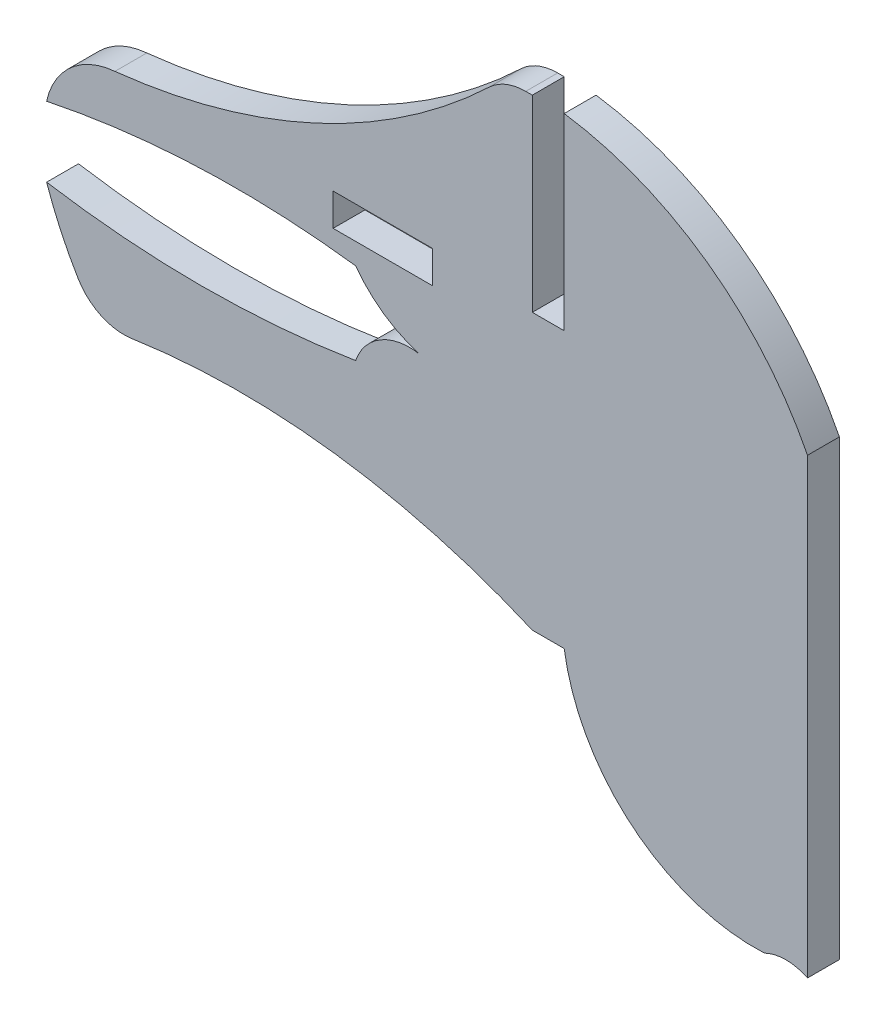
ISO-10303-21;
HEADER;
FILE_DESCRIPTION(('STEP AP214'),'2;1');
FILE_NAME('part.step','',(''),(''),'','','');
FILE_SCHEMA(('AUTOMOTIVE_DESIGN { 1 0 10303 214 1 1 1 1 }'));
ENDSEC;
DATA;
#1=APPLICATION_CONTEXT('core data for automotive mechanical design processes');
#2=APPLICATION_PROTOCOL_DEFINITION('international standard','automotive_design',2000,#1);
#3=PRODUCT_CONTEXT('',#1,'mechanical');
#4=PRODUCT('Part','Part','',(#3));
#5=PRODUCT_RELATED_PRODUCT_CATEGORY('part','',(#4));
#6=PRODUCT_DEFINITION_FORMATION('','',#4);
#7=PRODUCT_DEFINITION_CONTEXT('part definition',#1,'design');
#8=PRODUCT_DEFINITION('design','',#6,#7);
#9=PRODUCT_DEFINITION_SHAPE('','',#8);
#10=(LENGTH_UNIT() NAMED_UNIT(*) SI_UNIT(.MILLI.,.METRE.));
#11=(NAMED_UNIT(*) PLANE_ANGLE_UNIT() SI_UNIT($,.RADIAN.));
#12=(NAMED_UNIT(*) SI_UNIT($,.STERADIAN.) SOLID_ANGLE_UNIT());
#13=UNCERTAINTY_MEASURE_WITH_UNIT(LENGTH_MEASURE(1.E-05),#10,'distance_accuracy_value','');
#14=(GEOMETRIC_REPRESENTATION_CONTEXT(3) GLOBAL_UNCERTAINTY_ASSIGNED_CONTEXT((#13)) GLOBAL_UNIT_ASSIGNED_CONTEXT((#10,
#11,#12)) REPRESENTATION_CONTEXT('',''));
#15=CARTESIAN_POINT('',(0.,0.,0.));
#16=DIRECTION('',(0.,0.,1.));
#17=DIRECTION('',(1.,0.,0.));
#18=AXIS2_PLACEMENT_3D('',#15,#16,#17);
#19=CARTESIAN_POINT('',(-2.17746130734827,9.10857617639714,1.524));
#20=DIRECTION('',(0.,0.,-1.));
#21=DIRECTION('',(-1.,0.,0.));
#22=AXIS2_PLACEMENT_3D('',#19,#20,#21);
#23=PLANE('',#22);
#24=DIRECTION('',(0.,-1.,0.));
#25=VECTOR('',#24,1.);
#26=CARTESIAN_POINT('',(0.,15.4404111186023,1.524));
#27=LINE('',#26,#25);
#28=CARTESIAN_POINT('',(0.,24.4351758524362,1.524));
#29=VERTEX_POINT('',#28);
#30=CARTESIAN_POINT('',(0.,15.4404111186023,1.524));
#31=VERTEX_POINT('',#30);
#32=EDGE_CURVE('E221',#29,#31,#27,.T.);
#33=ORIENTED_EDGE('',*,*,#32,.T.);
#34=DIRECTION('',(-1.,0.,0.));
#35=VECTOR('',#34,1.);
#36=CARTESIAN_POINT('',(0.,15.4404111186023,1.524));
#37=LINE('',#36,#35);
#38=CARTESIAN_POINT('',(-1.524,15.4404111186023,1.524));
#39=VERTEX_POINT('',#38);
#40=EDGE_CURVE('E224',#31,#39,#37,.T.);
#41=ORIENTED_EDGE('',*,*,#40,.T.);
#42=DIRECTION('',(0.,1.,0.));
#43=VECTOR('',#42,1.);
#44=CARTESIAN_POINT('',(-1.524,15.4404111186023,1.524));
#45=LINE('',#44,#43);
#46=CARTESIAN_POINT('',(-1.524,24.4351758524362,1.524));
#47=VERTEX_POINT('',#46);
#48=EDGE_CURVE('E227',#39,#47,#45,.T.);
#49=ORIENTED_EDGE('',*,*,#48,.T.);
#50=DIRECTION('',(-1.,0.,0.));
#51=VECTOR('',#50,1.);
#52=CARTESIAN_POINT('',(-1.524,24.4351758524362,1.524));
#53=LINE('',#52,#51);
#54=CARTESIAN_POINT('',(-1.83677867417803,24.4351758524362,1.524));
#55=VERTEX_POINT('',#54);
#56=EDGE_CURVE('E229',#47,#55,#53,.T.);
#57=ORIENTED_EDGE('',*,*,#56,.T.);
#58=CARTESIAN_POINT('',(-1.83677867417803,21.8951758524362,1.524));
#59=DIRECTION('',(0.,0.,1.));
#60=DIRECTION('',(1.,0.,0.));
#61=AXIS2_PLACEMENT_3D('',#58,#59,#60);
#62=CIRCLE('',#61,2.54);
#63=CARTESIAN_POINT('',(-3.58920349451574,23.7338186260777,1.524));
#64=VERTEX_POINT('',#63);
#65=EDGE_CURVE('E231',#55,#64,#62,.T.);
#66=ORIENTED_EDGE('',*,*,#65,.T.);
#67=CARTESIAN_POINT('',(-24.7471923791564,45.9327642904265,1.524));
#68=DIRECTION('',(0.,0.,-1.));
#69=DIRECTION('',(-1.,0.,0.));
#70=AXIS2_PLACEMENT_3D('',#67,#68,#69);
#71=CIRCLE('',#70,30.6668172827127);
#72=CARTESIAN_POINT('',(-21.4806834941186,15.4404111186023,1.524));
#73=VERTEX_POINT('',#72);
#74=EDGE_CURVE('E233',#64,#73,#71,.T.);
#75=ORIENTED_EDGE('',*,*,#74,.T.);
#76=CARTESIAN_POINT('',(-21.172457197436,11.7960237267086,1.524));
#77=DIRECTION('',(0.,0.,1.));
#78=DIRECTION('',(1.,0.,0.));
#79=AXIS2_PLACEMENT_3D('',#76,#77,#78);
#80=CIRCLE('',#79,3.6573983802917);
#81=CARTESIAN_POINT('',(-24.7471923791564,12.5692192341518,1.524));
#82=VERTEX_POINT('',#81);
#83=EDGE_CURVE('E235',#73,#82,#80,.T.);
#84=ORIENTED_EDGE('',*,*,#83,.T.);
#85=CARTESIAN_POINT('',(-15.6510089215253,-31.1556557756089,1.524));
#86=DIRECTION('',(0.,0.,-1.));
#87=DIRECTION('',(-1.,0.,0.));
#88=AXIS2_PLACEMENT_3D('',#85,#86,#87);
#89=CIRCLE('',#88,44.6610036621892);
#90=CARTESIAN_POINT('',(-9.97279177913877,13.1429119009874,1.524));
#91=VERTEX_POINT('',#90);
#92=EDGE_CURVE('E237',#82,#91,#89,.T.);
#93=ORIENTED_EDGE('',*,*,#92,.T.);
#94=CARTESIAN_POINT('',(-5.35148518065487,16.5259518202602,1.524));
#95=DIRECTION('',(0.,0.,1.));
#96=DIRECTION('',(1.,0.,0.));
#97=AXIS2_PLACEMENT_3D('',#94,#95,#96);
#98=CIRCLE('',#97,5.72725359771888);
#99=CARTESIAN_POINT('',(-6.9059223319127,11.0136783405267,1.524));
#100=VERTEX_POINT('',#99);
#101=EDGE_CURVE('E239',#91,#100,#98,.T.);
#102=ORIENTED_EDGE('',*,*,#101,.T.);
#103=CARTESIAN_POINT('',(-7.3881311477758,8.31986254893477,1.524));
#104=DIRECTION('',(0.,0.,1.));
#105=DIRECTION('',(1.,0.,0.));
#106=AXIS2_PLACEMENT_3D('',#103,#104,#105);
#107=CIRCLE('',#106,2.73663458670061);
#108=CARTESIAN_POINT('',(-9.97279177913877,9.21913908138094,1.524));
#109=VERTEX_POINT('',#108);
#110=EDGE_CURVE('E241',#100,#109,#107,.T.);
#111=ORIENTED_EDGE('',*,*,#110,.T.);
#112=CARTESIAN_POINT('',(-17.3599920791476,54.9064911056629,1.524));
#113=DIRECTION('',(0.,0.,-1.));
#114=DIRECTION('',(-1.,0.,0.));
#115=AXIS2_PLACEMENT_3D('',#112,#113,#114);
#116=CIRCLE('',#115,46.2807180504269);
#117=CARTESIAN_POINT('',(-24.7471923791564,9.21913908138094,1.524));
#118=VERTEX_POINT('',#117);
#119=EDGE_CURVE('E243',#109,#118,#116,.T.);
#120=ORIENTED_EDGE('',*,*,#119,.T.);
#121=CARTESIAN_POINT('',(-8.62738716595611,14.7511932063634,1.524));
#122=DIRECTION('',(0.,0.,1.));
#123=DIRECTION('',(1.,0.,0.));
#124=AXIS2_PLACEMENT_3D('',#121,#122,#123);
#125=CIRCLE('',#124,17.0426448344515);
#126=CARTESIAN_POINT('',(-23.2415795241672,5.98323308610391,1.524));
#127=VERTEX_POINT('',#126);
#128=EDGE_CURVE('E245',#118,#127,#125,.T.);
#129=ORIENTED_EDGE('',*,*,#128,.T.);
#130=CARTESIAN_POINT('',(-21.0635109819642,7.28999145147448,1.524));
#131=DIRECTION('',(0.,0.,1.));
#132=DIRECTION('',(1.,0.,0.));
#133=AXIS2_PLACEMENT_3D('',#130,#131,#132);
#134=CIRCLE('',#133,2.54);
#135=CARTESIAN_POINT('',(-20.6892752704858,4.77771208160849,1.524));
#136=VERTEX_POINT('',#135);
#137=EDGE_CURVE('E247',#127,#136,#134,.T.);
#138=ORIENTED_EDGE('',*,*,#137,.T.);
#139=CARTESIAN_POINT('',(-15.4904405327496,-30.1225522661208,1.524));
#140=DIRECTION('',(0.,0.,-1.));
#141=DIRECTION('',(-1.,0.,0.));
#142=AXIS2_PLACEMENT_3D('',#139,#140,#141);
#143=CIRCLE('',#142,35.2853558033879);
#144=CARTESIAN_POINT('',(-1.524,2.28107211475434,1.524));
#145=VERTEX_POINT('',#144);
#146=EDGE_CURVE('E249',#136,#145,#143,.T.);
#147=ORIENTED_EDGE('',*,*,#146,.T.);
#148=DIRECTION('',(1.,0.,0.));
#149=VECTOR('',#148,1.);
#150=CARTESIAN_POINT('',(-1.524,2.28107211475434,1.524));
#151=LINE('',#150,#149);
#152=CARTESIAN_POINT('',(0.,2.28107211475434,1.524));
#153=VERTEX_POINT('',#152);
#154=EDGE_CURVE('E251',#145,#153,#151,.T.);
#155=ORIENTED_EDGE('',*,*,#154,.T.);
#156=CARTESIAN_POINT('',(9.12449001778718,3.67526044076234,1.524));
#157=DIRECTION('',(0.,0.,1.));
#158=DIRECTION('',(1.,0.,0.));
#159=AXIS2_PLACEMENT_3D('',#156,#157,#158);
#160=CIRCLE('',#159,9.23038889609072);
#161=CARTESIAN_POINT('',(9.57377877406707,-5.54418741616247,1.524));
#162=VERTEX_POINT('',#161);
#163=EDGE_CURVE('E253',#153,#162,#160,.T.);
#164=ORIENTED_EDGE('',*,*,#163,.T.);
#165=CARTESIAN_POINT('',(10.6038513011269,-7.65293443311951,1.524));
#166=DIRECTION('',(0.,0.,-1.));
#167=DIRECTION('',(1.,0.,0.));
#168=AXIS2_PLACEMENT_3D('',#165,#166,#167);
#169=CIRCLE('',#168,2.34688376204035);
#170=CARTESIAN_POINT('',(11.6339238281867,-5.54418741616247,1.524));
#171=VERTEX_POINT('',#170);
#172=EDGE_CURVE('E255',#162,#171,#169,.T.);
#173=ORIENTED_EDGE('',*,*,#172,.T.);
#174=DIRECTION('',(0.,1.,0.));
#175=VECTOR('',#174,1.);
#176=CARTESIAN_POINT('',(11.6339238281867,16.1008316074066,1.524));
#177=LINE('',#176,#175);
#178=CARTESIAN_POINT('',(11.6339238281867,16.1008316074066,1.524));
#179=VERTEX_POINT('',#178);
#180=EDGE_CURVE('E257',#171,#179,#177,.T.);
#181=ORIENTED_EDGE('',*,*,#180,.T.);
#182=CARTESIAN_POINT('',(-2.17746130734827,9.10857617639714,1.524));
#183=DIRECTION('',(0.,0.,1.));
#184=DIRECTION('',(-1.,0.,0.));
#185=AXIS2_PLACEMENT_3D('',#182,#183,#184);
#186=CIRCLE('',#185,15.4805037183729);
#187=EDGE_CURVE('E259',#179,#29,#186,.T.);
#188=ORIENTED_EDGE('',*,*,#187,.T.);
#189=EDGE_LOOP('',(#33,#41,#49,#57,#66,#75,#84,#93,#102,#111,#120,#129,#138,#147,#155,#164,#173,
#181,#188));
#190=FACE_BOUND('',#189,.T.);
#191=DIRECTION('',(0.,-1.,0.));
#192=VECTOR('',#191,1.);
#193=CARTESIAN_POINT('',(-11.049,15.7018868321709,1.524));
#194=LINE('',#193,#192);
#195=CARTESIAN_POINT('',(-11.049,15.7018868321709,1.524));
#196=VERTEX_POINT('',#195);
#197=CARTESIAN_POINT('',(-11.049,14.1562025878202,1.524));
#198=VERTEX_POINT('',#197);
#199=EDGE_CURVE('E185',#196,#198,#194,.T.);
#200=ORIENTED_EDGE('',*,*,#199,.F.);
#201=DIRECTION('',(-1.,0.,0.));
#202=VECTOR('',#201,1.);
#203=CARTESIAN_POINT('',(-11.049,15.7018868321709,1.524));
#204=LINE('',#203,#202);
#205=CARTESIAN_POINT('',(-6.2865,15.7018868321709,1.524));
#206=VERTEX_POINT('',#205);
#207=EDGE_CURVE('E207',#206,#196,#204,.T.);
#208=ORIENTED_EDGE('',*,*,#207,.F.);
#209=DIRECTION('',(0.,1.,0.));
#210=VECTOR('',#209,1.);
#211=CARTESIAN_POINT('',(-6.2865,15.7018868321709,1.524));
#212=LINE('',#211,#210);
#213=CARTESIAN_POINT('',(-6.2865,14.1562025878202,1.524));
#214=VERTEX_POINT('',#213);
#215=EDGE_CURVE('E205',#214,#206,#212,.T.);
#216=ORIENTED_EDGE('',*,*,#215,.F.);
#217=DIRECTION('',(1.,0.,0.));
#218=VECTOR('',#217,1.);
#219=CARTESIAN_POINT('',(-11.049,14.1562025878202,1.524));
#220=LINE('',#219,#218);
#221=EDGE_CURVE('E193',#198,#214,#220,.T.);
#222=ORIENTED_EDGE('',*,*,#221,.F.);
#223=EDGE_LOOP('',(#200,#208,#216,#222));
#224=FACE_BOUND('',#223,.T.);
#225=ADVANCED_FACE('F30',(#190,#224),#23,.F.);
#226=CARTESIAN_POINT('',(-2.17746130734827,9.10857617639714,0.));
#227=DIRECTION('',(0.,0.,-1.));
#228=DIRECTION('',(-1.,0.,0.));
#229=AXIS2_PLACEMENT_3D('',#226,#227,#228);
#230=PLANE('',#229);
#231=DIRECTION('',(0.,-1.,0.));
#232=VECTOR('',#231,1.);
#233=CARTESIAN_POINT('',(0.,15.4404111186023,0.));
#234=LINE('',#233,#232);
#235=CARTESIAN_POINT('',(0.,24.4351758524362,0.));
#236=VERTEX_POINT('',#235);
#237=CARTESIAN_POINT('',(0.,15.4404111186023,0.));
#238=VERTEX_POINT('',#237);
#239=EDGE_CURVE('E201',#236,#238,#234,.T.);
#240=ORIENTED_EDGE('',*,*,#239,.F.);
#241=CARTESIAN_POINT('',(-2.17746130734827,9.10857617639714,0.));
#242=DIRECTION('',(0.,0.,1.));
#243=DIRECTION('',(-1.,0.,0.));
#244=AXIS2_PLACEMENT_3D('',#241,#242,#243);
#245=CIRCLE('',#244,15.4805037183729);
#246=CARTESIAN_POINT('',(11.6339238281867,16.1008316074066,0.));
#247=VERTEX_POINT('',#246);
#248=EDGE_CURVE('E225',#247,#236,#245,.T.);
#249=ORIENTED_EDGE('',*,*,#248,.F.);
#250=DIRECTION('',(0.,1.,0.));
#251=VECTOR('',#250,1.);
#252=CARTESIAN_POINT('',(11.6339238281867,16.1008316074066,0.));
#253=LINE('',#252,#251);
#254=CARTESIAN_POINT('',(11.6339238281867,-5.54418741616247,0.));
#255=VERTEX_POINT('',#254);
#256=EDGE_CURVE('E296',#255,#247,#253,.T.);
#257=ORIENTED_EDGE('',*,*,#256,.F.);
#258=CARTESIAN_POINT('',(10.6038513011269,-7.65293443311951,0.));
#259=DIRECTION('',(0.,0.,-1.));
#260=DIRECTION('',(1.,0.,0.));
#261=AXIS2_PLACEMENT_3D('',#258,#259,#260);
#262=CIRCLE('',#261,2.34688376204035);
#263=CARTESIAN_POINT('',(9.57377877406707,-5.54418741616247,0.));
#264=VERTEX_POINT('',#263);
#265=EDGE_CURVE('E294',#264,#255,#262,.T.);
#266=ORIENTED_EDGE('',*,*,#265,.F.);
#267=CARTESIAN_POINT('',(9.12449001778718,3.67526044076234,0.));
#268=DIRECTION('',(0.,0.,1.));
#269=DIRECTION('',(1.,0.,0.));
#270=AXIS2_PLACEMENT_3D('',#267,#268,#269);
#271=CIRCLE('',#270,9.23038889609072);
#272=CARTESIAN_POINT('',(0.,2.28107211475434,0.));
#273=VERTEX_POINT('',#272);
#274=EDGE_CURVE('E292',#273,#264,#271,.T.);
#275=ORIENTED_EDGE('',*,*,#274,.F.);
#276=DIRECTION('',(1.,0.,0.));
#277=VECTOR('',#276,1.);
#278=CARTESIAN_POINT('',(-1.524,2.28107211475434,0.));
#279=LINE('',#278,#277);
#280=CARTESIAN_POINT('',(-1.524,2.28107211475434,0.));
#281=VERTEX_POINT('',#280);
#282=EDGE_CURVE('E290',#281,#273,#279,.T.);
#283=ORIENTED_EDGE('',*,*,#282,.F.);
#284=CARTESIAN_POINT('',(-15.4904405327496,-30.1225522661208,0.));
#285=DIRECTION('',(0.,0.,-1.));
#286=DIRECTION('',(-1.,0.,0.));
#287=AXIS2_PLACEMENT_3D('',#284,#285,#286);
#288=CIRCLE('',#287,35.2853558033879);
#289=CARTESIAN_POINT('',(-20.6892752704858,4.77771208160849,0.));
#290=VERTEX_POINT('',#289);
#291=EDGE_CURVE('E288',#290,#281,#288,.T.);
#292=ORIENTED_EDGE('',*,*,#291,.F.);
#293=CARTESIAN_POINT('',(-21.0635109819642,7.28999145147448,0.));
#294=DIRECTION('',(0.,0.,1.));
#295=DIRECTION('',(1.,0.,0.));
#296=AXIS2_PLACEMENT_3D('',#293,#294,#295);
#297=CIRCLE('',#296,2.54);
#298=CARTESIAN_POINT('',(-23.2415795241672,5.98323308610391,0.));
#299=VERTEX_POINT('',#298);
#300=EDGE_CURVE('E286',#299,#290,#297,.T.);
#301=ORIENTED_EDGE('',*,*,#300,.F.);
#302=CARTESIAN_POINT('',(-8.62738716595611,14.7511932063634,0.));
#303=DIRECTION('',(0.,0.,1.));
#304=DIRECTION('',(1.,0.,0.));
#305=AXIS2_PLACEMENT_3D('',#302,#303,#304);
#306=CIRCLE('',#305,17.0426448344515);
#307=CARTESIAN_POINT('',(-24.7471923791564,9.21913908138094,0.));
#308=VERTEX_POINT('',#307);
#309=EDGE_CURVE('E284',#308,#299,#306,.T.);
#310=ORIENTED_EDGE('',*,*,#309,.F.);
#311=CARTESIAN_POINT('',(-17.3599920791476,54.9064911056629,0.));
#312=DIRECTION('',(0.,0.,-1.));
#313=DIRECTION('',(-1.,0.,0.));
#314=AXIS2_PLACEMENT_3D('',#311,#312,#313);
#315=CIRCLE('',#314,46.2807180504269);
#316=CARTESIAN_POINT('',(-9.97279177913877,9.21913908138094,0.));
#317=VERTEX_POINT('',#316);
#318=EDGE_CURVE('E282',#317,#308,#315,.T.);
#319=ORIENTED_EDGE('',*,*,#318,.F.);
#320=CARTESIAN_POINT('',(-7.3881311477758,8.31986254893477,0.));
#321=DIRECTION('',(0.,0.,1.));
#322=DIRECTION('',(1.,0.,0.));
#323=AXIS2_PLACEMENT_3D('',#320,#321,#322);
#324=CIRCLE('',#323,2.73663458670061);
#325=CARTESIAN_POINT('',(-6.9059223319127,11.0136783405267,0.));
#326=VERTEX_POINT('',#325);
#327=EDGE_CURVE('E280',#326,#317,#324,.T.);
#328=ORIENTED_EDGE('',*,*,#327,.F.);
#329=CARTESIAN_POINT('',(-5.35148518065487,16.5259518202602,0.));
#330=DIRECTION('',(0.,0.,1.));
#331=DIRECTION('',(1.,0.,0.));
#332=AXIS2_PLACEMENT_3D('',#329,#330,#331);
#333=CIRCLE('',#332,5.72725359771888);
#334=CARTESIAN_POINT('',(-9.97279177913877,13.1429119009874,0.));
#335=VERTEX_POINT('',#334);
#336=EDGE_CURVE('E278',#335,#326,#333,.T.);
#337=ORIENTED_EDGE('',*,*,#336,.F.);
#338=CARTESIAN_POINT('',(-15.6510089215253,-31.1556557756089,0.));
#339=DIRECTION('',(0.,0.,-1.));
#340=DIRECTION('',(-1.,0.,0.));
#341=AXIS2_PLACEMENT_3D('',#338,#339,#340);
#342=CIRCLE('',#341,44.6610036621892);
#343=CARTESIAN_POINT('',(-24.7471923791564,12.5692192341518,0.));
#344=VERTEX_POINT('',#343);
#345=EDGE_CURVE('E276',#344,#335,#342,.T.);
#346=ORIENTED_EDGE('',*,*,#345,.F.);
#347=CARTESIAN_POINT('',(-21.172457197436,11.7960237267086,0.));
#348=DIRECTION('',(0.,0.,1.));
#349=DIRECTION('',(1.,0.,0.));
#350=AXIS2_PLACEMENT_3D('',#347,#348,#349);
#351=CIRCLE('',#350,3.6573983802917);
#352=CARTESIAN_POINT('',(-21.4806834941186,15.4404111186023,0.));
#353=VERTEX_POINT('',#352);
#354=EDGE_CURVE('E274',#353,#344,#351,.T.);
#355=ORIENTED_EDGE('',*,*,#354,.F.);
#356=CARTESIAN_POINT('',(-24.7471923791564,45.9327642904265,0.));
#357=DIRECTION('',(0.,0.,-1.));
#358=DIRECTION('',(-1.,0.,0.));
#359=AXIS2_PLACEMENT_3D('',#356,#357,#358);
#360=CIRCLE('',#359,30.6668172827127);
#361=CARTESIAN_POINT('',(-3.58920349451574,23.7338186260777,0.));
#362=VERTEX_POINT('',#361);
#363=EDGE_CURVE('E272',#362,#353,#360,.T.);
#364=ORIENTED_EDGE('',*,*,#363,.F.);
#365=CARTESIAN_POINT('',(-1.83677867417803,21.8951758524362,0.));
#366=DIRECTION('',(0.,0.,1.));
#367=DIRECTION('',(1.,0.,0.));
#368=AXIS2_PLACEMENT_3D('',#365,#366,#367);
#369=CIRCLE('',#368,2.54);
#370=CARTESIAN_POINT('',(-1.83677867417803,24.4351758524362,0.));
#371=VERTEX_POINT('',#370);
#372=EDGE_CURVE('E270',#371,#362,#369,.T.);
#373=ORIENTED_EDGE('',*,*,#372,.F.);
#374=DIRECTION('',(-1.,0.,0.));
#375=VECTOR('',#374,1.);
#376=CARTESIAN_POINT('',(-1.524,24.4351758524362,0.));
#377=LINE('',#376,#375);
#378=CARTESIAN_POINT('',(-1.524,24.4351758524362,0.));
#379=VERTEX_POINT('',#378);
#380=EDGE_CURVE('E268',#379,#371,#377,.T.);
#381=ORIENTED_EDGE('',*,*,#380,.F.);
#382=DIRECTION('',(0.,1.,0.));
#383=VECTOR('',#382,1.);
#384=CARTESIAN_POINT('',(-1.524,15.4404111186023,0.));
#385=LINE('',#384,#383);
#386=CARTESIAN_POINT('',(-1.524,15.4404111186023,0.));
#387=VERTEX_POINT('',#386);
#388=EDGE_CURVE('E266',#387,#379,#385,.T.);
#389=ORIENTED_EDGE('',*,*,#388,.F.);
#390=DIRECTION('',(-1.,0.,0.));
#391=VECTOR('',#390,1.);
#392=CARTESIAN_POINT('',(0.,15.4404111186023,0.));
#393=LINE('',#392,#391);
#394=EDGE_CURVE('E264',#238,#387,#393,.T.);
#395=ORIENTED_EDGE('',*,*,#394,.F.);
#396=EDGE_LOOP('',(#240,#249,#257,#266,#275,#283,#292,#301,#310,#319,#328,#337,#346,#355,#364,
#373,#381,#389,#395));
#397=FACE_BOUND('',#396,.T.);
#398=DIRECTION('',(-1.,0.,0.));
#399=VECTOR('',#398,1.);
#400=CARTESIAN_POINT('',(-11.049,15.7018868321709,0.));
#401=LINE('',#400,#399);
#402=CARTESIAN_POINT('',(-6.2865,15.7018868321709,0.));
#403=VERTEX_POINT('',#402);
#404=CARTESIAN_POINT('',(-11.049,15.7018868321709,0.));
#405=VERTEX_POINT('',#404);
#406=EDGE_CURVE('E194',#403,#405,#401,.T.);
#407=ORIENTED_EDGE('',*,*,#406,.T.);
#408=DIRECTION('',(0.,-1.,0.));
#409=VECTOR('',#408,1.);
#410=CARTESIAN_POINT('',(-11.049,15.7018868321709,0.));
#411=LINE('',#410,#409);
#412=CARTESIAN_POINT('',(-11.049,14.1562025878202,0.));
#413=VERTEX_POINT('',#412);
#414=EDGE_CURVE('E53',#405,#413,#411,.T.);
#415=ORIENTED_EDGE('',*,*,#414,.T.);
#416=DIRECTION('',(1.,0.,0.));
#417=VECTOR('',#416,1.);
#418=CARTESIAN_POINT('',(-11.049,14.1562025878202,0.));
#419=LINE('',#418,#417);
#420=CARTESIAN_POINT('',(-6.2865,14.1562025878202,0.));
#421=VERTEX_POINT('',#420);
#422=EDGE_CURVE('E200',#413,#421,#419,.T.);
#423=ORIENTED_EDGE('',*,*,#422,.T.);
#424=DIRECTION('',(0.,1.,0.));
#425=VECTOR('',#424,1.);
#426=CARTESIAN_POINT('',(-6.2865,15.7018868321709,0.));
#427=LINE('',#426,#425);
#428=EDGE_CURVE('E213',#421,#403,#427,.T.);
#429=ORIENTED_EDGE('',*,*,#428,.T.);
#430=EDGE_LOOP('',(#407,#415,#423,#429));
#431=FACE_BOUND('',#430,.T.);
#432=ADVANCED_FACE('F359',(#397,#431),#230,.T.);
#433=CARTESIAN_POINT('',(0.,15.4404111186023,1.524));
#434=DIRECTION('',(1.,0.,0.));
#435=DIRECTION('',(0.,0.,-1.));
#436=AXIS2_PLACEMENT_3D('',#433,#434,#435);
#437=PLANE('',#436);
#438=ORIENTED_EDGE('',*,*,#239,.T.);
#439=DIRECTION('',(0.,0.,-1.));
#440=VECTOR('',#439,1.);
#441=CARTESIAN_POINT('',(0.,15.4404111186023,1.524));
#442=LINE('',#441,#440);
#443=EDGE_CURVE('E11',#31,#238,#442,.T.);
#444=ORIENTED_EDGE('',*,*,#443,.F.);
#445=ORIENTED_EDGE('',*,*,#32,.F.);
#446=DIRECTION('',(0.,0.,-1.));
#447=VECTOR('',#446,1.);
#448=CARTESIAN_POINT('',(0.,24.4351758524362,1.524));
#449=LINE('',#448,#447);
#450=EDGE_CURVE('E261',#29,#236,#449,.T.);
#451=ORIENTED_EDGE('',*,*,#450,.T.);
#452=EDGE_LOOP('',(#438,#444,#445,#451));
#453=FACE_BOUND('',#452,.T.);
#454=ADVANCED_FACE('F32',(#453),#437,.F.);
#455=CARTESIAN_POINT('',(0.,15.4404111186023,1.524));
#456=DIRECTION('',(0.,-1.,0.));
#457=DIRECTION('',(0.,0.,-1.));
#458=AXIS2_PLACEMENT_3D('',#455,#456,#457);
#459=PLANE('',#458);
#460=ORIENTED_EDGE('',*,*,#394,.T.);
#461=DIRECTION('',(0.,0.,-1.));
#462=VECTOR('',#461,1.);
#463=CARTESIAN_POINT('',(-1.524,15.4404111186023,1.524));
#464=LINE('',#463,#462);
#465=EDGE_CURVE('E38',#39,#387,#464,.T.);
#466=ORIENTED_EDGE('',*,*,#465,.F.);
#467=ORIENTED_EDGE('',*,*,#40,.F.);
#468=ORIENTED_EDGE('',*,*,#443,.T.);
#469=EDGE_LOOP('',(#460,#466,#467,#468));
#470=FACE_BOUND('',#469,.T.);
#471=ADVANCED_FACE('F376',(#470),#459,.F.);
#472=CARTESIAN_POINT('',(-1.524,15.4404111186023,1.524));
#473=DIRECTION('',(-1.,0.,0.));
#474=DIRECTION('',(0.,0.,1.));
#475=AXIS2_PLACEMENT_3D('',#472,#473,#474);
#476=PLANE('',#475);
#477=ORIENTED_EDGE('',*,*,#388,.T.);
#478=DIRECTION('',(0.,0.,-1.));
#479=VECTOR('',#478,1.);
#480=CARTESIAN_POINT('',(-1.524,24.4351758524362,1.524));
#481=LINE('',#480,#479);
#482=EDGE_CURVE('E346',#47,#379,#481,.T.);
#483=ORIENTED_EDGE('',*,*,#482,.F.);
#484=ORIENTED_EDGE('',*,*,#48,.F.);
#485=ORIENTED_EDGE('',*,*,#465,.T.);
#486=EDGE_LOOP('',(#477,#483,#484,#485));
#487=FACE_BOUND('',#486,.T.);
#488=ADVANCED_FACE('F353',(#487),#476,.F.);
#489=CARTESIAN_POINT('',(-1.524,24.4351758524362,1.524));
#490=DIRECTION('',(0.,-1.,0.));
#491=DIRECTION('',(0.,0.,-1.));
#492=AXIS2_PLACEMENT_3D('',#489,#490,#491);
#493=PLANE('',#492);
#494=ORIENTED_EDGE('',*,*,#380,.T.);
#495=DIRECTION('',(0.,0.,-1.));
#496=VECTOR('',#495,1.);
#497=CARTESIAN_POINT('',(-1.83677867417803,24.4351758524362,1.524));
#498=LINE('',#497,#496);
#499=EDGE_CURVE('E343',#55,#371,#498,.T.);
#500=ORIENTED_EDGE('',*,*,#499,.F.);
#501=ORIENTED_EDGE('',*,*,#56,.F.);
#502=ORIENTED_EDGE('',*,*,#482,.T.);
#503=EDGE_LOOP('',(#494,#500,#501,#502));
#504=FACE_BOUND('',#503,.T.);
#505=ADVANCED_FACE('F365',(#504),#493,.F.);
#506=CARTESIAN_POINT('',(-1.83677867417803,21.8951758524362,1.524));
#507=DIRECTION('',(0.,0.,-1.));
#508=DIRECTION('',(-1.,0.,0.));
#509=AXIS2_PLACEMENT_3D('',#506,#507,#508);
#510=CYLINDRICAL_SURFACE('',#509,2.54);
#511=ORIENTED_EDGE('',*,*,#372,.T.);
#512=DIRECTION('',(0.,0.,-1.));
#513=VECTOR('',#512,1.);
#514=CARTESIAN_POINT('',(-3.58920349451574,23.7338186260777,1.524));
#515=LINE('',#514,#513);
#516=EDGE_CURVE('E340',#64,#362,#515,.T.);
#517=ORIENTED_EDGE('',*,*,#516,.F.);
#518=ORIENTED_EDGE('',*,*,#65,.F.);
#519=ORIENTED_EDGE('',*,*,#499,.T.);
#520=EDGE_LOOP('',(#511,#517,#518,#519));
#521=FACE_BOUND('',#520,.T.);
#522=ADVANCED_FACE('F369',(#521),#510,.T.);
#523=CARTESIAN_POINT('',(-24.7471923791564,45.9327642904265,1.524));
#524=DIRECTION('',(0.,0.,-1.));
#525=DIRECTION('',(-1.,0.,0.));
#526=AXIS2_PLACEMENT_3D('',#523,#524,#525);
#527=CYLINDRICAL_SURFACE('',#526,30.6668172827127);
#528=ORIENTED_EDGE('',*,*,#363,.T.);
#529=DIRECTION('',(0.,0.,-1.));
#530=VECTOR('',#529,1.);
#531=CARTESIAN_POINT('',(-21.4806834941186,15.4404111186023,1.524));
#532=LINE('',#531,#530);
#533=EDGE_CURVE('E337',#73,#353,#532,.T.);
#534=ORIENTED_EDGE('',*,*,#533,.F.);
#535=ORIENTED_EDGE('',*,*,#74,.F.);
#536=ORIENTED_EDGE('',*,*,#516,.T.);
#537=EDGE_LOOP('',(#528,#534,#535,#536));
#538=FACE_BOUND('',#537,.T.);
#539=ADVANCED_FACE('F444',(#538),#527,.F.);
#540=CARTESIAN_POINT('',(-21.172457197436,11.7960237267086,1.524));
#541=DIRECTION('',(0.,0.,-1.));
#542=DIRECTION('',(-1.,0.,0.));
#543=AXIS2_PLACEMENT_3D('',#540,#541,#542);
#544=CYLINDRICAL_SURFACE('',#543,3.6573983802917);
#545=ORIENTED_EDGE('',*,*,#354,.T.);
#546=DIRECTION('',(0.,0.,-1.));
#547=VECTOR('',#546,1.);
#548=CARTESIAN_POINT('',(-24.7471923791564,12.5692192341518,1.524));
#549=LINE('',#548,#547);
#550=EDGE_CURVE('E334',#82,#344,#549,.T.);
#551=ORIENTED_EDGE('',*,*,#550,.F.);
#552=ORIENTED_EDGE('',*,*,#83,.F.);
#553=ORIENTED_EDGE('',*,*,#533,.T.);
#554=EDGE_LOOP('',(#545,#551,#552,#553));
#555=FACE_BOUND('',#554,.T.);
#556=ADVANCED_FACE('F441',(#555),#544,.T.);
#557=CARTESIAN_POINT('',(-15.6510089215253,-31.1556557756089,1.524));
#558=DIRECTION('',(0.,0.,-1.));
#559=DIRECTION('',(-1.,0.,0.));
#560=AXIS2_PLACEMENT_3D('',#557,#558,#559);
#561=CYLINDRICAL_SURFACE('',#560,44.6610036621892);
#562=ORIENTED_EDGE('',*,*,#345,.T.);
#563=DIRECTION('',(0.,0.,-1.));
#564=VECTOR('',#563,1.);
#565=CARTESIAN_POINT('',(-9.97279177913877,13.1429119009874,1.524));
#566=LINE('',#565,#564);
#567=EDGE_CURVE('E331',#91,#335,#566,.T.);
#568=ORIENTED_EDGE('',*,*,#567,.F.);
#569=ORIENTED_EDGE('',*,*,#92,.F.);
#570=ORIENTED_EDGE('',*,*,#550,.T.);
#571=EDGE_LOOP('',(#562,#568,#569,#570));
#572=FACE_BOUND('',#571,.T.);
#573=ADVANCED_FACE('F437',(#572),#561,.F.);
#574=CARTESIAN_POINT('',(-5.35148518065487,16.5259518202602,1.524));
#575=DIRECTION('',(0.,0.,-1.));
#576=DIRECTION('',(-1.,0.,0.));
#577=AXIS2_PLACEMENT_3D('',#574,#575,#576);
#578=CYLINDRICAL_SURFACE('',#577,5.72725359771888);
#579=ORIENTED_EDGE('',*,*,#336,.T.);
#580=DIRECTION('',(0.,0.,-1.));
#581=VECTOR('',#580,1.);
#582=CARTESIAN_POINT('',(-6.9059223319127,11.0136783405267,1.524));
#583=LINE('',#582,#581);
#584=EDGE_CURVE('E328',#100,#326,#583,.T.);
#585=ORIENTED_EDGE('',*,*,#584,.F.);
#586=ORIENTED_EDGE('',*,*,#101,.F.);
#587=ORIENTED_EDGE('',*,*,#567,.T.);
#588=EDGE_LOOP('',(#579,#585,#586,#587));
#589=FACE_BOUND('',#588,.T.);
#590=ADVANCED_FACE('F433',(#589),#578,.T.);
#591=CARTESIAN_POINT('',(-7.3881311477758,8.31986254893477,1.524));
#592=DIRECTION('',(0.,0.,-1.));
#593=DIRECTION('',(-1.,0.,0.));
#594=AXIS2_PLACEMENT_3D('',#591,#592,#593);
#595=CYLINDRICAL_SURFACE('',#594,2.73663458670061);
#596=ORIENTED_EDGE('',*,*,#327,.T.);
#597=DIRECTION('',(0.,0.,-1.));
#598=VECTOR('',#597,1.);
#599=CARTESIAN_POINT('',(-9.97279177913877,9.21913908138094,1.524));
#600=LINE('',#599,#598);
#601=EDGE_CURVE('E325',#109,#317,#600,.T.);
#602=ORIENTED_EDGE('',*,*,#601,.F.);
#603=ORIENTED_EDGE('',*,*,#110,.F.);
#604=ORIENTED_EDGE('',*,*,#584,.T.);
#605=EDGE_LOOP('',(#596,#602,#603,#604));
#606=FACE_BOUND('',#605,.T.);
#607=ADVANCED_FACE('F428',(#606),#595,.T.);
#608=CARTESIAN_POINT('',(-17.3599920791476,54.9064911056629,1.524));
#609=DIRECTION('',(0.,0.,-1.));
#610=DIRECTION('',(-1.,0.,0.));
#611=AXIS2_PLACEMENT_3D('',#608,#609,#610);
#612=CYLINDRICAL_SURFACE('',#611,46.2807180504269);
#613=ORIENTED_EDGE('',*,*,#318,.T.);
#614=DIRECTION('',(0.,0.,-1.));
#615=VECTOR('',#614,1.);
#616=CARTESIAN_POINT('',(-24.7471923791564,9.21913908138094,1.524));
#617=LINE('',#616,#615);
#618=EDGE_CURVE('E322',#118,#308,#617,.T.);
#619=ORIENTED_EDGE('',*,*,#618,.F.);
#620=ORIENTED_EDGE('',*,*,#119,.F.);
#621=ORIENTED_EDGE('',*,*,#601,.T.);
#622=EDGE_LOOP('',(#613,#619,#620,#621));
#623=FACE_BOUND('',#622,.T.);
#624=ADVANCED_FACE('F422',(#623),#612,.F.);
#625=CARTESIAN_POINT('',(-8.62738716595611,14.7511932063634,1.524));
#626=DIRECTION('',(0.,0.,-1.));
#627=DIRECTION('',(-1.,0.,0.));
#628=AXIS2_PLACEMENT_3D('',#625,#626,#627);
#629=CYLINDRICAL_SURFACE('',#628,17.0426448344515);
#630=ORIENTED_EDGE('',*,*,#309,.T.);
#631=DIRECTION('',(0.,0.,-1.));
#632=VECTOR('',#631,1.);
#633=CARTESIAN_POINT('',(-23.2415795241672,5.98323308610391,1.524));
#634=LINE('',#633,#632);
#635=EDGE_CURVE('E319',#127,#299,#634,.T.);
#636=ORIENTED_EDGE('',*,*,#635,.F.);
#637=ORIENTED_EDGE('',*,*,#128,.F.);
#638=ORIENTED_EDGE('',*,*,#618,.T.);
#639=EDGE_LOOP('',(#630,#636,#637,#638));
#640=FACE_BOUND('',#639,.T.);
#641=ADVANCED_FACE('F418',(#640),#629,.T.);
#642=CARTESIAN_POINT('',(-21.0635109819642,7.28999145147448,1.524));
#643=DIRECTION('',(0.,0.,-1.));
#644=DIRECTION('',(-1.,0.,0.));
#645=AXIS2_PLACEMENT_3D('',#642,#643,#644);
#646=CYLINDRICAL_SURFACE('',#645,2.54);
#647=ORIENTED_EDGE('',*,*,#300,.T.);
#648=DIRECTION('',(0.,0.,-1.));
#649=VECTOR('',#648,1.);
#650=CARTESIAN_POINT('',(-20.6892752704858,4.77771208160849,1.524));
#651=LINE('',#650,#649);
#652=EDGE_CURVE('E316',#136,#290,#651,.T.);
#653=ORIENTED_EDGE('',*,*,#652,.F.);
#654=ORIENTED_EDGE('',*,*,#137,.F.);
#655=ORIENTED_EDGE('',*,*,#635,.T.);
#656=EDGE_LOOP('',(#647,#653,#654,#655));
#657=FACE_BOUND('',#656,.T.);
#658=ADVANCED_FACE('F413',(#657),#646,.T.);
#659=CARTESIAN_POINT('',(-15.4904405327496,-30.1225522661208,1.524));
#660=DIRECTION('',(0.,0.,-1.));
#661=DIRECTION('',(-1.,0.,0.));
#662=AXIS2_PLACEMENT_3D('',#659,#660,#661);
#663=CYLINDRICAL_SURFACE('',#662,35.2853558033879);
#664=ORIENTED_EDGE('',*,*,#291,.T.);
#665=DIRECTION('',(0.,0.,-1.));
#666=VECTOR('',#665,1.);
#667=CARTESIAN_POINT('',(-1.524,2.28107211475434,1.524));
#668=LINE('',#667,#666);
#669=EDGE_CURVE('E313',#145,#281,#668,.T.);
#670=ORIENTED_EDGE('',*,*,#669,.F.);
#671=ORIENTED_EDGE('',*,*,#146,.F.);
#672=ORIENTED_EDGE('',*,*,#652,.T.);
#673=EDGE_LOOP('',(#664,#670,#671,#672));
#674=FACE_BOUND('',#673,.T.);
#675=ADVANCED_FACE('F407',(#674),#663,.F.);
#676=CARTESIAN_POINT('',(-1.524,2.28107211475434,1.524));
#677=DIRECTION('',(0.,1.,0.));
#678=DIRECTION('',(0.,0.,1.));
#679=AXIS2_PLACEMENT_3D('',#676,#677,#678);
#680=PLANE('',#679);
#681=ORIENTED_EDGE('',*,*,#282,.T.);
#682=DIRECTION('',(0.,0.,-1.));
#683=VECTOR('',#682,1.);
#684=CARTESIAN_POINT('',(0.,2.28107211475434,1.524));
#685=LINE('',#684,#683);
#686=EDGE_CURVE('E310',#153,#273,#685,.T.);
#687=ORIENTED_EDGE('',*,*,#686,.F.);
#688=ORIENTED_EDGE('',*,*,#154,.F.);
#689=ORIENTED_EDGE('',*,*,#669,.T.);
#690=EDGE_LOOP('',(#681,#687,#688,#689));
#691=FACE_BOUND('',#690,.T.);
#692=ADVANCED_FACE('F403',(#691),#680,.F.);
#693=CARTESIAN_POINT('',(9.12449001778718,3.67526044076234,1.524));
#694=DIRECTION('',(0.,0.,-1.));
#695=DIRECTION('',(-1.,0.,0.));
#696=AXIS2_PLACEMENT_3D('',#693,#694,#695);
#697=CYLINDRICAL_SURFACE('',#696,9.23038889609072);
#698=ORIENTED_EDGE('',*,*,#274,.T.);
#699=DIRECTION('',(0.,0.,-1.));
#700=VECTOR('',#699,1.);
#701=CARTESIAN_POINT('',(9.57377877406707,-5.54418741616247,1.524));
#702=LINE('',#701,#700);
#703=EDGE_CURVE('E307',#162,#264,#702,.T.);
#704=ORIENTED_EDGE('',*,*,#703,.F.);
#705=ORIENTED_EDGE('',*,*,#163,.F.);
#706=ORIENTED_EDGE('',*,*,#686,.T.);
#707=EDGE_LOOP('',(#698,#704,#705,#706));
#708=FACE_BOUND('',#707,.T.);
#709=ADVANCED_FACE('F398',(#708),#697,.T.);
#710=CARTESIAN_POINT('',(10.6038513011269,-7.65293443311951,1.524));
#711=DIRECTION('',(0.,0.,-1.));
#712=DIRECTION('',(-1.,0.,0.));
#713=AXIS2_PLACEMENT_3D('',#710,#711,#712);
#714=CYLINDRICAL_SURFACE('',#713,2.34688376204035);
#715=ORIENTED_EDGE('',*,*,#265,.T.);
#716=DIRECTION('',(0.,0.,-1.));
#717=VECTOR('',#716,1.);
#718=CARTESIAN_POINT('',(11.6339238281867,-5.54418741616247,1.524));
#719=LINE('',#718,#717);
#720=EDGE_CURVE('E304',#171,#255,#719,.T.);
#721=ORIENTED_EDGE('',*,*,#720,.F.);
#722=ORIENTED_EDGE('',*,*,#172,.F.);
#723=ORIENTED_EDGE('',*,*,#703,.T.);
#724=EDGE_LOOP('',(#715,#721,#722,#723));
#725=FACE_BOUND('',#724,.T.);
#726=ADVANCED_FACE('F392',(#725),#714,.F.);
#727=CARTESIAN_POINT('',(11.6339238281867,16.1008316074066,1.524));
#728=DIRECTION('',(-1.,0.,0.));
#729=DIRECTION('',(0.,0.,1.));
#730=AXIS2_PLACEMENT_3D('',#727,#728,#729);
#731=PLANE('',#730);
#732=ORIENTED_EDGE('',*,*,#256,.T.);
#733=DIRECTION('',(0.,0.,-1.));
#734=VECTOR('',#733,1.);
#735=CARTESIAN_POINT('',(11.6339238281867,16.1008316074066,1.524));
#736=LINE('',#735,#734);
#737=EDGE_CURVE('E301',#179,#247,#736,.T.);
#738=ORIENTED_EDGE('',*,*,#737,.F.);
#739=ORIENTED_EDGE('',*,*,#180,.F.);
#740=ORIENTED_EDGE('',*,*,#720,.T.);
#741=EDGE_LOOP('',(#732,#738,#739,#740));
#742=FACE_BOUND('',#741,.T.);
#743=ADVANCED_FACE('F388',(#742),#731,.F.);
#744=CARTESIAN_POINT('',(-2.17746130734827,9.10857617639714,1.524));
#745=DIRECTION('',(0.,0.,-1.));
#746=DIRECTION('',(-1.,0.,0.));
#747=AXIS2_PLACEMENT_3D('',#744,#745,#746);
#748=CYLINDRICAL_SURFACE('',#747,15.4805037183729);
#749=ORIENTED_EDGE('',*,*,#248,.T.);
#750=ORIENTED_EDGE('',*,*,#450,.F.);
#751=ORIENTED_EDGE('',*,*,#187,.F.);
#752=ORIENTED_EDGE('',*,*,#737,.T.);
#753=EDGE_LOOP('',(#749,#750,#751,#752));
#754=FACE_BOUND('',#753,.T.);
#755=ADVANCED_FACE('F383',(#754),#748,.T.);
#756=CARTESIAN_POINT('',(-11.049,15.7018868321709,1.524));
#757=DIRECTION('',(1.,0.,0.));
#758=DIRECTION('',(0.,0.,-1.));
#759=AXIS2_PLACEMENT_3D('',#756,#757,#758);
#760=PLANE('',#759);
#761=ORIENTED_EDGE('',*,*,#414,.F.);
#762=DIRECTION('',(0.,0.,-1.));
#763=VECTOR('',#762,1.);
#764=CARTESIAN_POINT('',(-11.049,15.7018868321709,1.524));
#765=LINE('',#764,#763);
#766=EDGE_CURVE('E189',#196,#405,#765,.T.);
#767=ORIENTED_EDGE('',*,*,#766,.F.);
#768=ORIENTED_EDGE('',*,*,#199,.T.);
#769=DIRECTION('',(0.,0.,-1.));
#770=VECTOR('',#769,1.);
#771=CARTESIAN_POINT('',(-11.049,14.1562025878202,1.524));
#772=LINE('',#771,#770);
#773=EDGE_CURVE('E188',#198,#413,#772,.T.);
#774=ORIENTED_EDGE('',*,*,#773,.T.);
#775=EDGE_LOOP('',(#761,#767,#768,#774));
#776=FACE_BOUND('',#775,.T.);
#777=ADVANCED_FACE('F187',(#776),#760,.T.);
#778=CARTESIAN_POINT('',(-11.049,14.1562025878202,1.524));
#779=DIRECTION('',(0.,1.,0.));
#780=DIRECTION('',(0.,0.,1.));
#781=AXIS2_PLACEMENT_3D('',#778,#779,#780);
#782=PLANE('',#781);
#783=ORIENTED_EDGE('',*,*,#422,.F.);
#784=ORIENTED_EDGE('',*,*,#773,.F.);
#785=ORIENTED_EDGE('',*,*,#221,.T.);
#786=DIRECTION('',(0.,0.,-1.));
#787=VECTOR('',#786,1.);
#788=CARTESIAN_POINT('',(-6.2865,14.1562025878202,1.524));
#789=LINE('',#788,#787);
#790=EDGE_CURVE('E202',#214,#421,#789,.T.);
#791=ORIENTED_EDGE('',*,*,#790,.T.);
#792=EDGE_LOOP('',(#783,#784,#785,#791));
#793=FACE_BOUND('',#792,.T.);
#794=ADVANCED_FACE('F197',(#793),#782,.T.);
#795=CARTESIAN_POINT('',(-6.2865,15.7018868321709,1.524));
#796=DIRECTION('',(-1.,0.,0.));
#797=DIRECTION('',(0.,0.,1.));
#798=AXIS2_PLACEMENT_3D('',#795,#796,#797);
#799=PLANE('',#798);
#800=ORIENTED_EDGE('',*,*,#428,.F.);
#801=ORIENTED_EDGE('',*,*,#790,.F.);
#802=ORIENTED_EDGE('',*,*,#215,.T.);
#803=DIRECTION('',(0.,0.,-1.));
#804=VECTOR('',#803,1.);
#805=CARTESIAN_POINT('',(-6.2865,15.7018868321709,1.524));
#806=LINE('',#805,#804);
#807=EDGE_CURVE('E45',#206,#403,#806,.T.);
#808=ORIENTED_EDGE('',*,*,#807,.T.);
#809=EDGE_LOOP('',(#800,#801,#802,#808));
#810=FACE_BOUND('',#809,.T.);
#811=ADVANCED_FACE('F544',(#810),#799,.T.);
#812=CARTESIAN_POINT('',(-11.049,15.7018868321709,1.524));
#813=DIRECTION('',(0.,-1.,0.));
#814=DIRECTION('',(0.,0.,-1.));
#815=AXIS2_PLACEMENT_3D('',#812,#813,#814);
#816=PLANE('',#815);
#817=ORIENTED_EDGE('',*,*,#406,.F.);
#818=ORIENTED_EDGE('',*,*,#807,.F.);
#819=ORIENTED_EDGE('',*,*,#207,.T.);
#820=ORIENTED_EDGE('',*,*,#766,.T.);
#821=EDGE_LOOP('',(#817,#818,#819,#820));
#822=FACE_BOUND('',#821,.T.);
#823=ADVANCED_FACE('F550',(#822),#816,.T.);
#824=CLOSED_SHELL('',(#225,#432,#454,#471,#488,#505,#522,#539,#556,#573,#590,#607,#624,#641,
#658,#675,#692,#709,#726,#743,#755,#777,#794,#811,#823));
#825=MANIFOLD_SOLID_BREP('B2',#824);
#826=ADVANCED_BREP_SHAPE_REPRESENTATION('',(#18,#825),#14);
#827=SHAPE_DEFINITION_REPRESENTATION(#9,#826);
ENDSEC;
END-ISO-10303-21;
